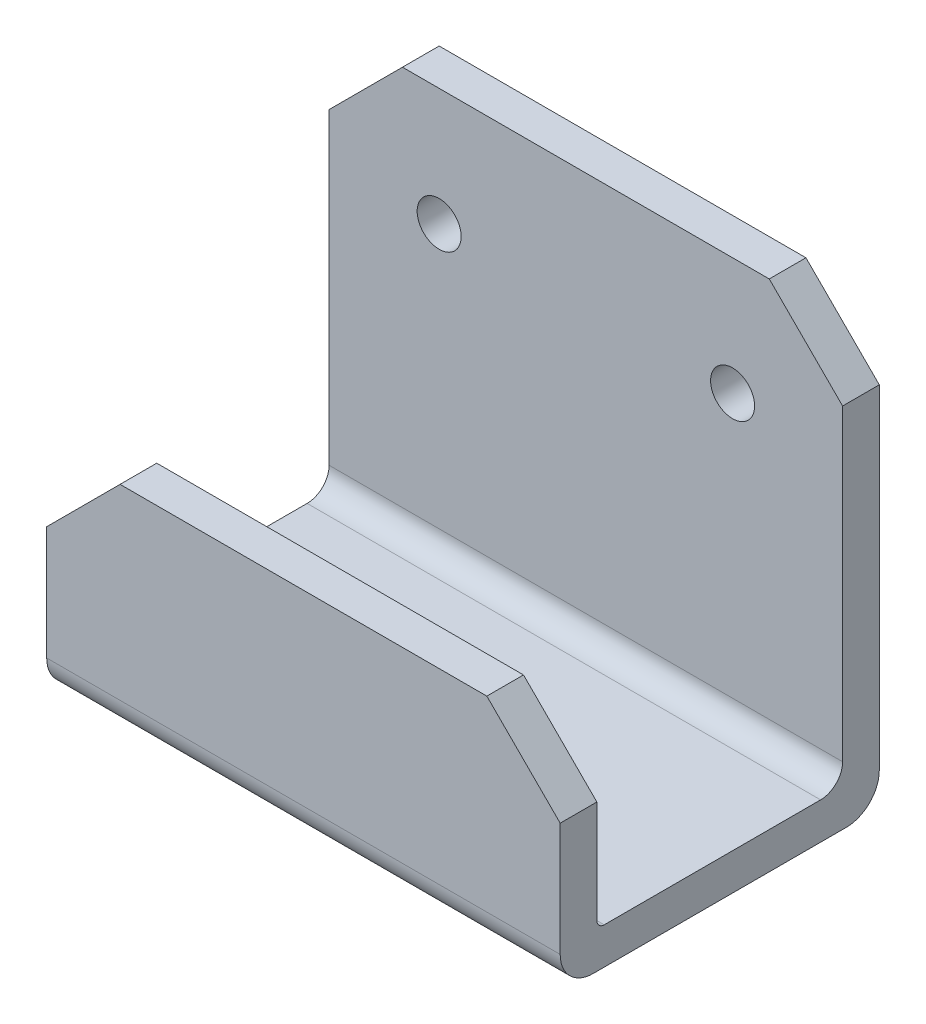
ISO-10303-21;
HEADER;
FILE_DESCRIPTION(('STEP AP214'),'2;1');
FILE_NAME('part.step','',(''),(''),'','','');
FILE_SCHEMA(('AUTOMOTIVE_DESIGN { 1 0 10303 214 1 1 1 1 }'));
ENDSEC;
DATA;
#1=APPLICATION_CONTEXT('core data for automotive mechanical design processes');
#2=APPLICATION_PROTOCOL_DEFINITION('international standard','automotive_design',2000,#1);
#3=PRODUCT_CONTEXT('',#1,'mechanical');
#4=PRODUCT('Part','Part','',(#3));
#5=PRODUCT_RELATED_PRODUCT_CATEGORY('part','',(#4));
#6=PRODUCT_DEFINITION_FORMATION('','',#4);
#7=PRODUCT_DEFINITION_CONTEXT('part definition',#1,'design');
#8=PRODUCT_DEFINITION('design','',#6,#7);
#9=PRODUCT_DEFINITION_SHAPE('','',#8);
#10=(LENGTH_UNIT() NAMED_UNIT(*) SI_UNIT(.MILLI.,.METRE.));
#11=(NAMED_UNIT(*) PLANE_ANGLE_UNIT() SI_UNIT($,.RADIAN.));
#12=(NAMED_UNIT(*) SI_UNIT($,.STERADIAN.) SOLID_ANGLE_UNIT());
#13=UNCERTAINTY_MEASURE_WITH_UNIT(LENGTH_MEASURE(1.E-05),#10,'distance_accuracy_value','');
#14=(GEOMETRIC_REPRESENTATION_CONTEXT(3) GLOBAL_UNCERTAINTY_ASSIGNED_CONTEXT((#13)) GLOBAL_UNIT_ASSIGNED_CONTEXT((#10,
#11,#12)) REPRESENTATION_CONTEXT('',''));
#15=CARTESIAN_POINT('',(0.,0.,0.));
#16=DIRECTION('',(0.,0.,1.));
#17=DIRECTION('',(1.,0.,0.));
#18=AXIS2_PLACEMENT_3D('',#15,#16,#17);
#19=CARTESIAN_POINT('',(-35.,10.,16.75));
#20=DIRECTION('',(0.,1.,0.));
#21=DIRECTION('',(0.,0.,1.));
#22=AXIS2_PLACEMENT_3D('',#19,#20,#21);
#23=PLANE('',#22);
#24=DIRECTION('',(1.,0.,0.));
#25=VECTOR('',#24,1.);
#26=CARTESIAN_POINT('',(-35.,10.,21.75));
#27=LINE('',#26,#25);
#28=CARTESIAN_POINT('',(-25.,10.,21.75));
#29=VERTEX_POINT('',#28);
#30=CARTESIAN_POINT('',(25.,10.,21.75));
#31=VERTEX_POINT('',#30);
#32=EDGE_CURVE('E188',#29,#31,#27,.T.);
#33=ORIENTED_EDGE('',*,*,#32,.T.);
#34=DIRECTION('',(0.,0.,-1.));
#35=VECTOR('',#34,1.);
#36=CARTESIAN_POINT('',(25.,10.,16.75));
#37=LINE('',#36,#35);
#38=CARTESIAN_POINT('',(25.,10.,16.75));
#39=VERTEX_POINT('',#38);
#40=EDGE_CURVE('E230',#31,#39,#37,.T.);
#41=ORIENTED_EDGE('',*,*,#40,.T.);
#42=DIRECTION('',(1.,0.,0.));
#43=VECTOR('',#42,1.);
#44=CARTESIAN_POINT('',(-35.,10.,16.75));
#45=LINE('',#44,#43);
#46=CARTESIAN_POINT('',(-25.,10.,16.75));
#47=VERTEX_POINT('',#46);
#48=EDGE_CURVE('E182',#47,#39,#45,.T.);
#49=ORIENTED_EDGE('',*,*,#48,.F.);
#50=DIRECTION('',(0.,0.,1.));
#51=VECTOR('',#50,1.);
#52=CARTESIAN_POINT('',(-25.,10.,21.75));
#53=LINE('',#52,#51);
#54=EDGE_CURVE('E226',#47,#29,#53,.T.);
#55=ORIENTED_EDGE('',*,*,#54,.T.);
#56=EDGE_LOOP('',(#33,#41,#49,#55));
#57=FACE_BOUND('',#56,.T.);
#58=ADVANCED_FACE('F41',(#57),#23,.T.);
#59=CARTESIAN_POINT('',(-35.,-15.,16.75));
#60=DIRECTION('',(0.,0.,-1.));
#61=DIRECTION('',(0.,1.,0.));
#62=AXIS2_PLACEMENT_3D('',#59,#60,#61);
#63=PLANE('',#62);
#64=DIRECTION('',(0.,1.,0.));
#65=VECTOR('',#64,1.);
#66=CARTESIAN_POINT('',(35.,-15.,16.75));
#67=LINE('',#66,#65);
#68=CARTESIAN_POINT('',(35.,-14.,16.75));
#69=VERTEX_POINT('',#68);
#70=CARTESIAN_POINT('',(35.,0.,16.75));
#71=VERTEX_POINT('',#70);
#72=EDGE_CURVE('E310',#69,#71,#67,.T.);
#73=ORIENTED_EDGE('',*,*,#72,.F.);
#74=DIRECTION('',(1.,0.,0.));
#75=VECTOR('',#74,1.);
#76=CARTESIAN_POINT('',(-35.,-14.,16.75));
#77=LINE('',#76,#75);
#78=CARTESIAN_POINT('',(-35.,-14.,16.75));
#79=VERTEX_POINT('',#78);
#80=EDGE_CURVE('E57',#69,#79,#77,.F.);
#81=ORIENTED_EDGE('',*,*,#80,.T.);
#82=DIRECTION('',(0.,1.,0.));
#83=VECTOR('',#82,1.);
#84=CARTESIAN_POINT('',(-35.,-15.,16.75));
#85=LINE('',#84,#83);
#86=CARTESIAN_POINT('',(-35.,0.,16.75));
#87=VERTEX_POINT('',#86);
#88=EDGE_CURVE('E195',#79,#87,#85,.T.);
#89=ORIENTED_EDGE('',*,*,#88,.T.);
#90=DIRECTION('',(0.707106781186547,0.707106781186548,0.));
#91=VECTOR('',#90,1.);
#92=CARTESIAN_POINT('',(-42.5,-7.5,16.75));
#93=LINE('',#92,#91);
#94=EDGE_CURVE('E233',#87,#47,#93,.T.);
#95=ORIENTED_EDGE('',*,*,#94,.T.);
#96=ORIENTED_EDGE('',*,*,#48,.T.);
#97=DIRECTION('',(-0.707106781186548,0.707106781186547,0.));
#98=VECTOR('',#97,1.);
#99=CARTESIAN_POINT('',(7.49999999999991,27.5,16.75));
#100=LINE('',#99,#98);
#101=EDGE_CURVE('E236',#39,#71,#100,.F.);
#102=ORIENTED_EDGE('',*,*,#101,.T.);
#103=EDGE_LOOP('',(#73,#81,#89,#95,#96,#102));
#104=FACE_BOUND('',#103,.T.);
#105=ADVANCED_FACE('F336',(#104),#63,.T.);
#106=CARTESIAN_POINT('',(-35.,-15.,-16.75));
#107=DIRECTION('',(0.,1.,0.));
#108=DIRECTION('',(0.,0.,1.));
#109=AXIS2_PLACEMENT_3D('',#106,#107,#108);
#110=PLANE('',#109);
#111=DIRECTION('',(0.,0.,1.));
#112=VECTOR('',#111,1.);
#113=CARTESIAN_POINT('',(-35.,-15.,-16.75));
#114=LINE('',#113,#112);
#115=CARTESIAN_POINT('',(-35.,-15.,-13.75));
#116=VERTEX_POINT('',#115);
#117=CARTESIAN_POINT('',(-35.,-15.,15.75));
#118=VERTEX_POINT('',#117);
#119=EDGE_CURVE('E303',#116,#118,#114,.T.);
#120=ORIENTED_EDGE('',*,*,#119,.T.);
#121=DIRECTION('',(1.,0.,0.));
#122=VECTOR('',#121,1.);
#123=CARTESIAN_POINT('',(35.,-15.,15.75));
#124=LINE('',#123,#122);
#125=CARTESIAN_POINT('',(35.,-15.,15.75));
#126=VERTEX_POINT('',#125);
#127=EDGE_CURVE('E289',#118,#126,#124,.T.);
#128=ORIENTED_EDGE('',*,*,#127,.T.);
#129=DIRECTION('',(0.,0.,1.));
#130=VECTOR('',#129,1.);
#131=CARTESIAN_POINT('',(35.,-15.,-16.75));
#132=LINE('',#131,#130);
#133=CARTESIAN_POINT('',(35.,-15.,-13.75));
#134=VERTEX_POINT('',#133);
#135=EDGE_CURVE('E300',#134,#126,#132,.T.);
#136=ORIENTED_EDGE('',*,*,#135,.F.);
#137=DIRECTION('',(1.,0.,0.));
#138=VECTOR('',#137,1.);
#139=CARTESIAN_POINT('',(-35.,-15.,-13.75));
#140=LINE('',#139,#138);
#141=EDGE_CURVE('E254',#134,#116,#140,.F.);
#142=ORIENTED_EDGE('',*,*,#141,.T.);
#143=EDGE_LOOP('',(#120,#128,#136,#142));
#144=FACE_BOUND('',#143,.T.);
#145=ADVANCED_FACE('F299',(#144),#110,.T.);
#146=CARTESIAN_POINT('',(-35.,40.,-16.75));
#147=DIRECTION('',(0.,0.,1.));
#148=DIRECTION('',(0.,-1.,0.));
#149=AXIS2_PLACEMENT_3D('',#146,#147,#148);
#150=PLANE('',#149);
#151=CARTESIAN_POINT('',(-20.,24.,-16.75));
#152=DIRECTION('',(0.,0.,1.));
#153=DIRECTION('',(1.,0.,0.));
#154=AXIS2_PLACEMENT_3D('',#151,#152,#153);
#155=CIRCLE('',#154,3.);
#156=CARTESIAN_POINT('',(-17.,24.,-16.75));
#157=VERTEX_POINT('',#156);
#158=EDGE_CURVE('E246',#157,#157,#155,.T.);
#159=ORIENTED_EDGE('',*,*,#158,.F.);
#160=EDGE_LOOP('',(#159));
#161=FACE_BOUND('',#160,.T.);
#162=CARTESIAN_POINT('',(20.,24.,-16.75));
#163=DIRECTION('',(0.,0.,1.));
#164=DIRECTION('',(1.,0.,0.));
#165=AXIS2_PLACEMENT_3D('',#162,#163,#164);
#166=CIRCLE('',#165,3.);
#167=CARTESIAN_POINT('',(23.,24.,-16.75));
#168=VERTEX_POINT('',#167);
#169=EDGE_CURVE('E386',#168,#168,#166,.T.);
#170=ORIENTED_EDGE('',*,*,#169,.F.);
#171=EDGE_LOOP('',(#170));
#172=FACE_BOUND('',#171,.T.);
#173=DIRECTION('',(0.,-1.,0.));
#174=VECTOR('',#173,1.);
#175=CARTESIAN_POINT('',(-35.,40.,-16.75));
#176=LINE('',#175,#174);
#177=CARTESIAN_POINT('',(-35.,29.9999999999999,-16.75));
#178=VERTEX_POINT('',#177);
#179=CARTESIAN_POINT('',(-35.,-12.,-16.75));
#180=VERTEX_POINT('',#179);
#181=EDGE_CURVE('E331',#178,#180,#176,.T.);
#182=ORIENTED_EDGE('',*,*,#181,.T.);
#183=DIRECTION('',(1.,0.,0.));
#184=VECTOR('',#183,1.);
#185=CARTESIAN_POINT('',(35.,-12.,-16.75));
#186=LINE('',#185,#184);
#187=CARTESIAN_POINT('',(35.,-12.,-16.75));
#188=VERTEX_POINT('',#187);
#189=EDGE_CURVE('E240',#180,#188,#186,.T.);
#190=ORIENTED_EDGE('',*,*,#189,.T.);
#191=DIRECTION('',(0.,-1.,0.));
#192=VECTOR('',#191,1.);
#193=CARTESIAN_POINT('',(35.,40.,-16.75));
#194=LINE('',#193,#192);
#195=CARTESIAN_POINT('',(35.,30.,-16.75));
#196=VERTEX_POINT('',#195);
#197=EDGE_CURVE('E311',#196,#188,#194,.T.);
#198=ORIENTED_EDGE('',*,*,#197,.F.);
#199=DIRECTION('',(0.707106781186549,-0.707106781186546,0.));
#200=VECTOR('',#199,1.);
#201=CARTESIAN_POINT('',(-5.00000000000014,70.,-16.75));
#202=LINE('',#201,#200);
#203=CARTESIAN_POINT('',(25.,40.,-16.75));
#204=VERTEX_POINT('',#203);
#205=EDGE_CURVE('E166',#196,#204,#202,.F.);
#206=ORIENTED_EDGE('',*,*,#205,.T.);
#207=DIRECTION('',(1.,0.,0.));
#208=VECTOR('',#207,1.);
#209=CARTESIAN_POINT('',(-35.,40.,-16.75));
#210=LINE('',#209,#208);
#211=CARTESIAN_POINT('',(-25.,40.,-16.75));
#212=VERTEX_POINT('',#211);
#213=EDGE_CURVE('E172',#212,#204,#210,.T.);
#214=ORIENTED_EDGE('',*,*,#213,.F.);
#215=DIRECTION('',(-0.707106781186546,-0.707106781186549,0.));
#216=VECTOR('',#215,1.);
#217=CARTESIAN_POINT('',(-30.,35.,-16.75));
#218=LINE('',#217,#216);
#219=EDGE_CURVE('E153',#212,#178,#218,.T.);
#220=ORIENTED_EDGE('',*,*,#219,.T.);
#221=EDGE_LOOP('',(#182,#190,#198,#206,#214,#220));
#222=FACE_BOUND('',#221,.T.);
#223=ADVANCED_FACE('F179',(#161,#172,#222),#150,.T.);
#224=CARTESIAN_POINT('',(-35.,40.,-21.75));
#225=DIRECTION('',(0.,1.,0.));
#226=DIRECTION('',(0.,0.,1.));
#227=AXIS2_PLACEMENT_3D('',#224,#225,#226);
#228=PLANE('',#227);
#229=DIRECTION('',(1.,0.,0.));
#230=VECTOR('',#229,1.);
#231=CARTESIAN_POINT('',(-35.,40.,-21.75));
#232=LINE('',#231,#230);
#233=CARTESIAN_POINT('',(-25.,40.,-21.75));
#234=VERTEX_POINT('',#233);
#235=CARTESIAN_POINT('',(25.,40.,-21.75));
#236=VERTEX_POINT('',#235);
#237=EDGE_CURVE('E175',#234,#236,#232,.T.);
#238=ORIENTED_EDGE('',*,*,#237,.F.);
#239=DIRECTION('',(0.,0.,1.));
#240=VECTOR('',#239,1.);
#241=CARTESIAN_POINT('',(-25.,40.,-16.75));
#242=LINE('',#241,#240);
#243=EDGE_CURVE('E157',#234,#212,#242,.T.);
#244=ORIENTED_EDGE('',*,*,#243,.T.);
#245=ORIENTED_EDGE('',*,*,#213,.T.);
#246=DIRECTION('',(0.,0.,-1.));
#247=VECTOR('',#246,1.);
#248=CARTESIAN_POINT('',(25.,40.,-21.75));
#249=LINE('',#248,#247);
#250=EDGE_CURVE('E177',#204,#236,#249,.T.);
#251=ORIENTED_EDGE('',*,*,#250,.T.);
#252=EDGE_LOOP('',(#238,#244,#245,#251));
#253=FACE_BOUND('',#252,.T.);
#254=ADVANCED_FACE('F171',(#253),#228,.T.);
#255=CARTESIAN_POINT('',(-35.,-20.,-21.75));
#256=DIRECTION('',(0.,0.,-1.));
#257=DIRECTION('',(-1.,0.,0.));
#258=AXIS2_PLACEMENT_3D('',#255,#256,#257);
#259=PLANE('',#258);
#260=CARTESIAN_POINT('',(-20.,24.,-21.75));
#261=DIRECTION('',(0.,0.,-1.));
#262=DIRECTION('',(-1.,0.,0.));
#263=AXIS2_PLACEMENT_3D('',#260,#261,#262);
#264=CIRCLE('',#263,3.);
#265=CARTESIAN_POINT('',(-23.,24.,-21.75));
#266=VERTEX_POINT('',#265);
#267=EDGE_CURVE('E245',#266,#266,#264,.T.);
#268=ORIENTED_EDGE('',*,*,#267,.F.);
#269=EDGE_LOOP('',(#268));
#270=FACE_BOUND('',#269,.T.);
#271=CARTESIAN_POINT('',(20.,24.,-21.75));
#272=DIRECTION('',(0.,0.,-1.));
#273=DIRECTION('',(-1.,0.,0.));
#274=AXIS2_PLACEMENT_3D('',#271,#272,#273);
#275=CIRCLE('',#274,3.);
#276=CARTESIAN_POINT('',(17.,24.,-21.75));
#277=VERTEX_POINT('',#276);
#278=EDGE_CURVE('E241',#277,#277,#275,.T.);
#279=ORIENTED_EDGE('',*,*,#278,.F.);
#280=EDGE_LOOP('',(#279));
#281=FACE_BOUND('',#280,.T.);
#282=DIRECTION('',(0.,1.,0.));
#283=VECTOR('',#282,1.);
#284=CARTESIAN_POINT('',(35.,-20.,-21.75));
#285=LINE('',#284,#283);
#286=CARTESIAN_POINT('',(35.,-15.5,-21.75));
#287=VERTEX_POINT('',#286);
#288=CARTESIAN_POINT('',(35.,30.,-21.75));
#289=VERTEX_POINT('',#288);
#290=EDGE_CURVE('E317',#287,#289,#285,.T.);
#291=ORIENTED_EDGE('',*,*,#290,.F.);
#292=DIRECTION('',(1.,0.,0.));
#293=VECTOR('',#292,1.);
#294=CARTESIAN_POINT('',(-35.,-15.5,-21.75));
#295=LINE('',#294,#293);
#296=CARTESIAN_POINT('',(-35.,-15.5,-21.75));
#297=VERTEX_POINT('',#296);
#298=EDGE_CURVE('E286',#287,#297,#295,.F.);
#299=ORIENTED_EDGE('',*,*,#298,.T.);
#300=DIRECTION('',(0.,1.,0.));
#301=VECTOR('',#300,1.);
#302=CARTESIAN_POINT('',(-35.,-20.,-21.75));
#303=LINE('',#302,#301);
#304=CARTESIAN_POINT('',(-35.,30.,-21.75));
#305=VERTEX_POINT('',#304);
#306=EDGE_CURVE('E328',#297,#305,#303,.T.);
#307=ORIENTED_EDGE('',*,*,#306,.T.);
#308=DIRECTION('',(0.707106781186546,0.707106781186549,0.));
#309=VECTOR('',#308,1.);
#310=CARTESIAN_POINT('',(-60.,4.9999999999999,-21.75));
#311=LINE('',#310,#309);
#312=EDGE_CURVE('E209',#305,#234,#311,.T.);
#313=ORIENTED_EDGE('',*,*,#312,.T.);
#314=ORIENTED_EDGE('',*,*,#237,.T.);
#315=DIRECTION('',(-0.707106781186549,0.707106781186546,0.));
#316=VECTOR('',#315,1.);
#317=CARTESIAN_POINT('',(24.9999999999999,40.0000000000001,-21.75));
#318=LINE('',#317,#316);
#319=EDGE_CURVE('E205',#236,#289,#318,.F.);
#320=ORIENTED_EDGE('',*,*,#319,.T.);
#321=EDGE_LOOP('',(#291,#299,#307,#313,#314,#320));
#322=FACE_BOUND('',#321,.T.);
#323=ADVANCED_FACE('F367',(#270,#281,#322),#259,.T.);
#324=CARTESIAN_POINT('',(-35.,-20.,21.75));
#325=DIRECTION('',(0.,-1.,0.));
#326=DIRECTION('',(0.,0.,-1.));
#327=AXIS2_PLACEMENT_3D('',#324,#325,#326);
#328=PLANE('',#327);
#329=DIRECTION('',(0.,0.,-1.));
#330=VECTOR('',#329,1.);
#331=CARTESIAN_POINT('',(35.,-20.,21.75));
#332=LINE('',#331,#330);
#333=CARTESIAN_POINT('',(35.,-20.,17.25));
#334=VERTEX_POINT('',#333);
#335=CARTESIAN_POINT('',(35.,-20.,-17.25));
#336=VERTEX_POINT('',#335);
#337=EDGE_CURVE('E378',#334,#336,#332,.T.);
#338=ORIENTED_EDGE('',*,*,#337,.F.);
#339=DIRECTION('',(1.,0.,0.));
#340=VECTOR('',#339,1.);
#341=CARTESIAN_POINT('',(-35.,-20.,17.25));
#342=LINE('',#341,#340);
#343=CARTESIAN_POINT('',(-35.,-20.,17.25));
#344=VERTEX_POINT('',#343);
#345=EDGE_CURVE('E277',#334,#344,#342,.F.);
#346=ORIENTED_EDGE('',*,*,#345,.T.);
#347=DIRECTION('',(0.,0.,-1.));
#348=VECTOR('',#347,1.);
#349=CARTESIAN_POINT('',(-35.,-20.,21.75));
#350=LINE('',#349,#348);
#351=CARTESIAN_POINT('',(-35.,-20.,-17.25));
#352=VERTEX_POINT('',#351);
#353=EDGE_CURVE('E324',#344,#352,#350,.T.);
#354=ORIENTED_EDGE('',*,*,#353,.T.);
#355=DIRECTION('',(1.,0.,0.));
#356=VECTOR('',#355,1.);
#357=CARTESIAN_POINT('',(-35.,-20.,-17.25));
#358=LINE('',#357,#356);
#359=EDGE_CURVE('E273',#352,#336,#358,.T.);
#360=ORIENTED_EDGE('',*,*,#359,.T.);
#361=EDGE_LOOP('',(#338,#346,#354,#360));
#362=FACE_BOUND('',#361,.T.);
#363=ADVANCED_FACE('F377',(#362),#328,.T.);
#364=CARTESIAN_POINT('',(-35.,10.,21.75));
#365=DIRECTION('',(0.,0.,1.));
#366=DIRECTION('',(0.,-1.,0.));
#367=AXIS2_PLACEMENT_3D('',#364,#365,#366);
#368=PLANE('',#367);
#369=DIRECTION('',(0.,-1.,0.));
#370=VECTOR('',#369,1.);
#371=CARTESIAN_POINT('',(-35.,10.,21.75));
#372=LINE('',#371,#370);
#373=CARTESIAN_POINT('',(-35.,0.,21.75));
#374=VERTEX_POINT('',#373);
#375=CARTESIAN_POINT('',(-35.,-15.5,21.75));
#376=VERTEX_POINT('',#375);
#377=EDGE_CURVE('E315',#374,#376,#372,.T.);
#378=ORIENTED_EDGE('',*,*,#377,.T.);
#379=DIRECTION('',(1.,0.,0.));
#380=VECTOR('',#379,1.);
#381=CARTESIAN_POINT('',(-35.,-15.5,21.75));
#382=LINE('',#381,#380);
#383=CARTESIAN_POINT('',(35.,-15.5,21.75));
#384=VERTEX_POINT('',#383);
#385=EDGE_CURVE('E263',#376,#384,#382,.T.);
#386=ORIENTED_EDGE('',*,*,#385,.T.);
#387=DIRECTION('',(0.,-1.,0.));
#388=VECTOR('',#387,1.);
#389=CARTESIAN_POINT('',(35.,10.,21.75));
#390=LINE('',#389,#388);
#391=CARTESIAN_POINT('',(35.,0.,21.75));
#392=VERTEX_POINT('',#391);
#393=EDGE_CURVE('E250',#392,#384,#390,.T.);
#394=ORIENTED_EDGE('',*,*,#393,.F.);
#395=DIRECTION('',(0.707106781186548,-0.707106781186547,0.));
#396=VECTOR('',#395,1.);
#397=CARTESIAN_POINT('',(-5.00000000000009,40.,21.75));
#398=LINE('',#397,#396);
#399=EDGE_CURVE('E223',#392,#31,#398,.F.);
#400=ORIENTED_EDGE('',*,*,#399,.T.);
#401=ORIENTED_EDGE('',*,*,#32,.F.);
#402=DIRECTION('',(-0.707106781186547,-0.707106781186548,0.));
#403=VECTOR('',#402,1.);
#404=CARTESIAN_POINT('',(-30.,5.,21.75));
#405=LINE('',#404,#403);
#406=EDGE_CURVE('E220',#29,#374,#405,.T.);
#407=ORIENTED_EDGE('',*,*,#406,.T.);
#408=EDGE_LOOP('',(#378,#386,#394,#400,#401,#407));
#409=FACE_BOUND('',#408,.T.);
#410=ADVANCED_FACE('F351',(#409),#368,.T.);
#411=CARTESIAN_POINT('',(-35.,0.,0.));
#412=DIRECTION('',(1.,0.,0.));
#413=DIRECTION('',(0.,0.,-1.));
#414=AXIS2_PLACEMENT_3D('',#411,#412,#413);
#415=PLANE('',#414);
#416=ORIENTED_EDGE('',*,*,#353,.F.);
#417=CARTESIAN_POINT('',(-35.,-15.5,17.25));
#418=DIRECTION('',(1.,0.,0.));
#419=DIRECTION('',(0.,0.,-1.));
#420=AXIS2_PLACEMENT_3D('',#417,#418,#419);
#421=CIRCLE('',#420,4.5);
#422=EDGE_CURVE('E283',#344,#376,#421,.F.);
#423=ORIENTED_EDGE('',*,*,#422,.T.);
#424=ORIENTED_EDGE('',*,*,#377,.F.);
#425=DIRECTION('',(0.,0.,-1.));
#426=VECTOR('',#425,1.);
#427=CARTESIAN_POINT('',(-35.,0.,16.75));
#428=LINE('',#427,#426);
#429=EDGE_CURVE('E165',#374,#87,#428,.T.);
#430=ORIENTED_EDGE('',*,*,#429,.T.);
#431=ORIENTED_EDGE('',*,*,#88,.F.);
#432=CARTESIAN_POINT('',(-35.,-14.,15.75));
#433=DIRECTION('',(1.,0.,0.));
#434=DIRECTION('',(0.,0.,-1.));
#435=AXIS2_PLACEMENT_3D('',#432,#433,#434);
#436=CIRCLE('',#435,1.);
#437=EDGE_CURVE('E11',#79,#118,#436,.T.);
#438=ORIENTED_EDGE('',*,*,#437,.T.);
#439=ORIENTED_EDGE('',*,*,#119,.F.);
#440=CARTESIAN_POINT('',(-35.,-12.,-13.75));
#441=DIRECTION('',(1.,0.,0.));
#442=DIRECTION('',(0.,0.,-1.));
#443=AXIS2_PLACEMENT_3D('',#440,#441,#442);
#444=CIRCLE('',#443,3.);
#445=EDGE_CURVE('E260',#116,#180,#444,.T.);
#446=ORIENTED_EDGE('',*,*,#445,.T.);
#447=ORIENTED_EDGE('',*,*,#181,.F.);
#448=DIRECTION('',(0.,0.,-1.));
#449=VECTOR('',#448,1.);
#450=CARTESIAN_POINT('',(-35.,29.9999999999999,-21.75));
#451=LINE('',#450,#449);
#452=EDGE_CURVE('E159',#178,#305,#451,.T.);
#453=ORIENTED_EDGE('',*,*,#452,.T.);
#454=ORIENTED_EDGE('',*,*,#306,.F.);
#455=CARTESIAN_POINT('',(-35.,-15.5,-17.25));
#456=DIRECTION('',(1.,0.,0.));
#457=DIRECTION('',(0.,0.,-1.));
#458=AXIS2_PLACEMENT_3D('',#455,#456,#457);
#459=CIRCLE('',#458,4.5);
#460=EDGE_CURVE('E280',#297,#352,#459,.F.);
#461=ORIENTED_EDGE('',*,*,#460,.T.);
#462=EDGE_LOOP('',(#416,#423,#424,#430,#431,#438,#439,#446,#447,#453,#454,#461));
#463=FACE_BOUND('',#462,.T.);
#464=ADVANCED_FACE('F343',(#463),#415,.F.);
#465=CARTESIAN_POINT('',(35.,0.,0.));
#466=DIRECTION('',(1.,0.,0.));
#467=DIRECTION('',(0.,0.,-1.));
#468=AXIS2_PLACEMENT_3D('',#465,#466,#467);
#469=PLANE('',#468);
#470=ORIENTED_EDGE('',*,*,#393,.T.);
#471=CARTESIAN_POINT('',(35.,-15.5,17.25));
#472=DIRECTION('',(1.,0.,0.));
#473=DIRECTION('',(0.,0.,-1.));
#474=AXIS2_PLACEMENT_3D('',#471,#472,#473);
#475=CIRCLE('',#474,4.5);
#476=EDGE_CURVE('E270',#384,#334,#475,.T.);
#477=ORIENTED_EDGE('',*,*,#476,.T.);
#478=ORIENTED_EDGE('',*,*,#337,.T.);
#479=CARTESIAN_POINT('',(35.,-15.5,-17.25));
#480=DIRECTION('',(1.,0.,0.));
#481=DIRECTION('',(0.,0.,-1.));
#482=AXIS2_PLACEMENT_3D('',#479,#480,#481);
#483=CIRCLE('',#482,4.5);
#484=EDGE_CURVE('E267',#336,#287,#483,.T.);
#485=ORIENTED_EDGE('',*,*,#484,.T.);
#486=ORIENTED_EDGE('',*,*,#290,.T.);
#487=DIRECTION('',(0.,0.,1.));
#488=VECTOR('',#487,1.);
#489=CARTESIAN_POINT('',(35.,30.,0.));
#490=LINE('',#489,#488);
#491=EDGE_CURVE('E216',#289,#196,#490,.T.);
#492=ORIENTED_EDGE('',*,*,#491,.T.);
#493=ORIENTED_EDGE('',*,*,#197,.T.);
#494=CARTESIAN_POINT('',(35.,-12.,-13.75));
#495=DIRECTION('',(1.,0.,0.));
#496=DIRECTION('',(0.,0.,-1.));
#497=AXIS2_PLACEMENT_3D('',#494,#495,#496);
#498=CIRCLE('',#497,3.);
#499=EDGE_CURVE('E257',#188,#134,#498,.F.);
#500=ORIENTED_EDGE('',*,*,#499,.T.);
#501=ORIENTED_EDGE('',*,*,#135,.T.);
#502=CARTESIAN_POINT('',(35.,-14.,15.75));
#503=DIRECTION('',(1.,0.,0.));
#504=DIRECTION('',(0.,0.,-1.));
#505=AXIS2_PLACEMENT_3D('',#502,#503,#504);
#506=CIRCLE('',#505,1.);
#507=EDGE_CURVE('E50',#126,#69,#506,.F.);
#508=ORIENTED_EDGE('',*,*,#507,.T.);
#509=ORIENTED_EDGE('',*,*,#72,.T.);
#510=DIRECTION('',(0.,0.,1.));
#511=VECTOR('',#510,1.);
#512=CARTESIAN_POINT('',(35.,0.,0.));
#513=LINE('',#512,#511);
#514=EDGE_CURVE('E212',#71,#392,#513,.T.);
#515=ORIENTED_EDGE('',*,*,#514,.T.);
#516=EDGE_LOOP('',(#470,#477,#478,#485,#486,#492,#493,#500,#501,#508,#509,#515));
#517=FACE_BOUND('',#516,.T.);
#518=ADVANCED_FACE('F307',(#517),#469,.T.);
#519=CARTESIAN_POINT('',(-25.,40.,-21.75));
#520=DIRECTION('',(-0.707106781186549,0.707106781186546,0.));
#521=DIRECTION('',(0.,0.,-1.));
#522=AXIS2_PLACEMENT_3D('',#519,#520,#521);
#523=PLANE('',#522);
#524=ORIENTED_EDGE('',*,*,#312,.F.);
#525=ORIENTED_EDGE('',*,*,#452,.F.);
#526=ORIENTED_EDGE('',*,*,#219,.F.);
#527=ORIENTED_EDGE('',*,*,#243,.F.);
#528=EDGE_LOOP('',(#524,#525,#526,#527));
#529=FACE_BOUND('',#528,.T.);
#530=ADVANCED_FACE('F156',(#529),#523,.T.);
#531=CARTESIAN_POINT('',(35.,30.,0.));
#532=DIRECTION('',(-0.707106781186546,-0.707106781186549,0.));
#533=DIRECTION('',(0.,0.,1.));
#534=AXIS2_PLACEMENT_3D('',#531,#532,#533);
#535=PLANE('',#534);
#536=ORIENTED_EDGE('',*,*,#319,.F.);
#537=ORIENTED_EDGE('',*,*,#250,.F.);
#538=ORIENTED_EDGE('',*,*,#205,.F.);
#539=ORIENTED_EDGE('',*,*,#491,.F.);
#540=EDGE_LOOP('',(#536,#537,#538,#539));
#541=FACE_BOUND('',#540,.T.);
#542=ADVANCED_FACE('F365',(#541),#535,.F.);
#543=CARTESIAN_POINT('',(35.,0.,0.));
#544=DIRECTION('',(-0.707106781186547,-0.707106781186548,0.));
#545=DIRECTION('',(0.,0.,1.));
#546=AXIS2_PLACEMENT_3D('',#543,#544,#545);
#547=PLANE('',#546);
#548=ORIENTED_EDGE('',*,*,#101,.F.);
#549=ORIENTED_EDGE('',*,*,#40,.F.);
#550=ORIENTED_EDGE('',*,*,#399,.F.);
#551=ORIENTED_EDGE('',*,*,#514,.F.);
#552=EDGE_LOOP('',(#548,#549,#550,#551));
#553=FACE_BOUND('',#552,.T.);
#554=ADVANCED_FACE('F356',(#553),#547,.F.);
#555=CARTESIAN_POINT('',(-25.,10.,16.75));
#556=DIRECTION('',(-0.707106781186548,0.707106781186547,0.));
#557=DIRECTION('',(0.,0.,-1.));
#558=AXIS2_PLACEMENT_3D('',#555,#556,#557);
#559=PLANE('',#558);
#560=ORIENTED_EDGE('',*,*,#94,.F.);
#561=ORIENTED_EDGE('',*,*,#429,.F.);
#562=ORIENTED_EDGE('',*,*,#406,.F.);
#563=ORIENTED_EDGE('',*,*,#54,.F.);
#564=EDGE_LOOP('',(#560,#561,#562,#563));
#565=FACE_BOUND('',#564,.T.);
#566=ADVANCED_FACE('F346',(#565),#559,.T.);
#567=CARTESIAN_POINT('',(20.,24.,-51.75));
#568=DIRECTION('',(0.,0.,1.));
#569=DIRECTION('',(1.,0.,0.));
#570=AXIS2_PLACEMENT_3D('',#567,#568,#569);
#571=CYLINDRICAL_SURFACE('',#570,3.);
#572=ORIENTED_EDGE('',*,*,#278,.T.);
#573=EDGE_LOOP('',(#572));
#574=FACE_BOUND('',#573,.T.);
#575=ORIENTED_EDGE('',*,*,#169,.T.);
#576=EDGE_LOOP('',(#575));
#577=FACE_BOUND('',#576,.T.);
#578=ADVANCED_FACE('F401',(#574,#577),#571,.F.);
#579=CARTESIAN_POINT('',(-20.,24.,-51.75));
#580=DIRECTION('',(0.,0.,1.));
#581=DIRECTION('',(1.,0.,0.));
#582=AXIS2_PLACEMENT_3D('',#579,#580,#581);
#583=CYLINDRICAL_SURFACE('',#582,3.);
#584=ORIENTED_EDGE('',*,*,#267,.T.);
#585=EDGE_LOOP('',(#584));
#586=FACE_BOUND('',#585,.T.);
#587=ORIENTED_EDGE('',*,*,#158,.T.);
#588=EDGE_LOOP('',(#587));
#589=FACE_BOUND('',#588,.T.);
#590=ADVANCED_FACE('F394',(#586,#589),#583,.F.);
#591=CARTESIAN_POINT('',(-35.,-12.,-13.75));
#592=DIRECTION('',(-1.,0.,0.));
#593=DIRECTION('',(0.,0.,1.));
#594=AXIS2_PLACEMENT_3D('',#591,#592,#593);
#595=CYLINDRICAL_SURFACE('',#594,3.);
#596=ORIENTED_EDGE('',*,*,#445,.F.);
#597=ORIENTED_EDGE('',*,*,#141,.F.);
#598=ORIENTED_EDGE('',*,*,#499,.F.);
#599=ORIENTED_EDGE('',*,*,#189,.F.);
#600=EDGE_LOOP('',(#596,#597,#598,#599));
#601=FACE_BOUND('',#600,.T.);
#602=ADVANCED_FACE('F360',(#601),#595,.F.);
#603=CARTESIAN_POINT('',(-35.,-15.5,17.25));
#604=DIRECTION('',(1.,0.,0.));
#605=DIRECTION('',(0.,0.,-1.));
#606=AXIS2_PLACEMENT_3D('',#603,#604,#605);
#607=CYLINDRICAL_SURFACE('',#606,4.5);
#608=ORIENTED_EDGE('',*,*,#422,.F.);
#609=ORIENTED_EDGE('',*,*,#345,.F.);
#610=ORIENTED_EDGE('',*,*,#476,.F.);
#611=ORIENTED_EDGE('',*,*,#385,.F.);
#612=EDGE_LOOP('',(#608,#609,#610,#611));
#613=FACE_BOUND('',#612,.T.);
#614=ADVANCED_FACE('F442',(#613),#607,.T.);
#615=CARTESIAN_POINT('',(-35.,-15.5,-17.25));
#616=DIRECTION('',(1.,0.,0.));
#617=DIRECTION('',(0.,0.,-1.));
#618=AXIS2_PLACEMENT_3D('',#615,#616,#617);
#619=CYLINDRICAL_SURFACE('',#618,4.5);
#620=ORIENTED_EDGE('',*,*,#460,.F.);
#621=ORIENTED_EDGE('',*,*,#298,.F.);
#622=ORIENTED_EDGE('',*,*,#484,.F.);
#623=ORIENTED_EDGE('',*,*,#359,.F.);
#624=EDGE_LOOP('',(#620,#621,#622,#623));
#625=FACE_BOUND('',#624,.T.);
#626=ADVANCED_FACE('F373',(#625),#619,.T.);
#627=CARTESIAN_POINT('',(-35.,-14.,15.75));
#628=DIRECTION('',(-1.,0.,0.));
#629=DIRECTION('',(0.,0.,1.));
#630=AXIS2_PLACEMENT_3D('',#627,#628,#629);
#631=CYLINDRICAL_SURFACE('',#630,1.);
#632=ORIENTED_EDGE('',*,*,#437,.F.);
#633=ORIENTED_EDGE('',*,*,#80,.F.);
#634=ORIENTED_EDGE('',*,*,#507,.F.);
#635=ORIENTED_EDGE('',*,*,#127,.F.);
#636=EDGE_LOOP('',(#632,#633,#634,#635));
#637=FACE_BOUND('',#636,.T.);
#638=ADVANCED_FACE('F43',(#637),#631,.F.);
#639=CLOSED_SHELL('',(#58,#105,#145,#223,#254,#323,#363,#410,#464,#518,#530,#542,#554,#566,#578,
#590,#602,#614,#626,#638));
#640=MANIFOLD_SOLID_BREP('B2',#639);
#641=ADVANCED_BREP_SHAPE_REPRESENTATION('',(#18,#640),#14);
#642=SHAPE_DEFINITION_REPRESENTATION(#9,#641);
ENDSEC;
END-ISO-10303-21;
